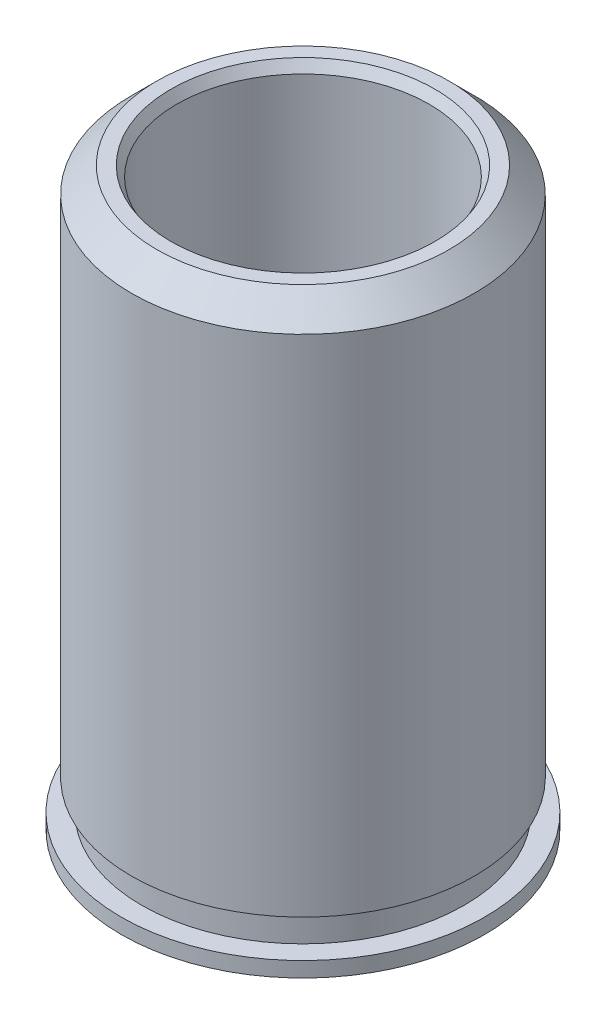
ISO-10303-21;
HEADER;
FILE_DESCRIPTION(('STEP AP214'),'2;1');
FILE_NAME('part.step','',(''),(''),'','','');
FILE_SCHEMA(('AUTOMOTIVE_DESIGN { 1 0 10303 214 1 1 1 1 }'));
ENDSEC;
DATA;
#1=APPLICATION_CONTEXT('core data for automotive mechanical design processes');
#2=APPLICATION_PROTOCOL_DEFINITION('international standard','automotive_design',2000,#1);
#3=PRODUCT_CONTEXT('',#1,'mechanical');
#4=PRODUCT('Part','Part','',(#3));
#5=PRODUCT_RELATED_PRODUCT_CATEGORY('part','',(#4));
#6=PRODUCT_DEFINITION_FORMATION('','',#4);
#7=PRODUCT_DEFINITION_CONTEXT('part definition',#1,'design');
#8=PRODUCT_DEFINITION('design','',#6,#7);
#9=PRODUCT_DEFINITION_SHAPE('','',#8);
#10=(LENGTH_UNIT() NAMED_UNIT(*) SI_UNIT(.MILLI.,.METRE.));
#11=(NAMED_UNIT(*) PLANE_ANGLE_UNIT() SI_UNIT($,.RADIAN.));
#12=(NAMED_UNIT(*) SI_UNIT($,.STERADIAN.) SOLID_ANGLE_UNIT());
#13=UNCERTAINTY_MEASURE_WITH_UNIT(LENGTH_MEASURE(1.E-05),#10,'distance_accuracy_value','');
#14=(GEOMETRIC_REPRESENTATION_CONTEXT(3) GLOBAL_UNCERTAINTY_ASSIGNED_CONTEXT((#13)) GLOBAL_UNIT_ASSIGNED_CONTEXT((#10,
#11,#12)) REPRESENTATION_CONTEXT('',''));
#15=CARTESIAN_POINT('',(0.,0.,0.));
#16=DIRECTION('',(0.,0.,1.));
#17=DIRECTION('',(1.,0.,0.));
#18=AXIS2_PLACEMENT_3D('',#15,#16,#17);
#19=CARTESIAN_POINT('',(0.,7.239,0.));
#20=DIRECTION('',(0.,1.,0.));
#21=DIRECTION('',(0.,0.,1.));
#22=AXIS2_PLACEMENT_3D('',#19,#20,#21);
#23=CYLINDRICAL_SURFACE('',#22,4.572);
#24=CARTESIAN_POINT('',(0.,-7.239,0.));
#25=DIRECTION('',(0.,1.,0.));
#26=DIRECTION('',(0.,0.,1.));
#27=AXIS2_PLACEMENT_3D('',#24,#25,#26);
#28=CIRCLE('',#27,4.572);
#29=CARTESIAN_POINT('',(0.,-7.239,4.572));
#30=VERTEX_POINT('',#29);
#31=EDGE_CURVE('E51',#30,#30,#28,.T.);
#32=ORIENTED_EDGE('',*,*,#31,.T.);
#33=EDGE_LOOP('',(#32));
#34=FACE_BOUND('',#33,.T.);
#35=CARTESIAN_POINT('',(0.,-6.858,0.));
#36=DIRECTION('',(0.,1.,0.));
#37=DIRECTION('',(0.,0.,1.));
#38=AXIS2_PLACEMENT_3D('',#35,#36,#37);
#39=CIRCLE('',#38,4.572);
#40=CARTESIAN_POINT('',(0.,-6.858,4.572));
#41=VERTEX_POINT('',#40);
#42=EDGE_CURVE('E9',#41,#41,#39,.T.);
#43=ORIENTED_EDGE('',*,*,#42,.F.);
#44=EDGE_LOOP('',(#43));
#45=FACE_BOUND('',#44,.T.);
#46=ADVANCED_FACE('F14',(#34,#45),#23,.T.);
#47=CARTESIAN_POINT('',(2.286,-6.858,0.));
#48=DIRECTION('',(0.,1.,0.));
#49=DIRECTION('',(0.,0.,1.));
#50=AXIS2_PLACEMENT_3D('',#47,#48,#49);
#51=PLANE('',#50);
#52=ORIENTED_EDGE('',*,*,#42,.T.);
#53=EDGE_LOOP('',(#52));
#54=FACE_BOUND('',#53,.T.);
#55=CARTESIAN_POINT('',(0.,-6.858,0.));
#56=DIRECTION('',(0.,1.,0.));
#57=DIRECTION('',(0.,0.,1.));
#58=AXIS2_PLACEMENT_3D('',#55,#56,#57);
#59=CIRCLE('',#58,4.05765);
#60=CARTESIAN_POINT('',(0.,-6.858,4.05765));
#61=VERTEX_POINT('',#60);
#62=EDGE_CURVE('E20',#61,#61,#59,.T.);
#63=ORIENTED_EDGE('',*,*,#62,.F.);
#64=EDGE_LOOP('',(#63));
#65=FACE_BOUND('',#64,.T.);
#66=ADVANCED_FACE('F77',(#54,#65),#51,.T.);
#67=CARTESIAN_POINT('',(0.,7.239,0.));
#68=DIRECTION('',(0.,1.,0.));
#69=DIRECTION('',(0.,0.,1.));
#70=AXIS2_PLACEMENT_3D('',#67,#68,#69);
#71=CYLINDRICAL_SURFACE('',#70,4.05765);
#72=ORIENTED_EDGE('',*,*,#62,.T.);
#73=EDGE_LOOP('',(#72));
#74=FACE_BOUND('',#73,.T.);
#75=CARTESIAN_POINT('',(0.,-6.096,0.));
#76=DIRECTION('',(0.,1.,0.));
#77=DIRECTION('',(0.,0.,1.));
#78=AXIS2_PLACEMENT_3D('',#75,#76,#77);
#79=CIRCLE('',#78,4.05765);
#80=CARTESIAN_POINT('',(0.,-6.096,4.05765));
#81=VERTEX_POINT('',#80);
#82=EDGE_CURVE('E24',#81,#81,#79,.T.);
#83=ORIENTED_EDGE('',*,*,#82,.F.);
#84=EDGE_LOOP('',(#83));
#85=FACE_BOUND('',#84,.T.);
#86=ADVANCED_FACE('F82',(#74,#85),#71,.T.);
#87=CARTESIAN_POINT('',(2.286,-6.096,0.));
#88=DIRECTION('',(0.,-1.,0.));
#89=DIRECTION('',(0.,0.,-1.));
#90=AXIS2_PLACEMENT_3D('',#87,#88,#89);
#91=PLANE('',#90);
#92=ORIENTED_EDGE('',*,*,#82,.T.);
#93=EDGE_LOOP('',(#92));
#94=FACE_BOUND('',#93,.T.);
#95=CARTESIAN_POINT('',(0.,-6.096,0.));
#96=DIRECTION('',(0.,1.,0.));
#97=DIRECTION('',(0.,0.,1.));
#98=AXIS2_PLACEMENT_3D('',#95,#96,#97);
#99=CIRCLE('',#98,4.31165);
#100=CARTESIAN_POINT('',(0.,-6.096,4.31165));
#101=VERTEX_POINT('',#100);
#102=EDGE_CURVE('E28',#101,#101,#99,.T.);
#103=ORIENTED_EDGE('',*,*,#102,.F.);
#104=EDGE_LOOP('',(#103));
#105=FACE_BOUND('',#104,.T.);
#106=ADVANCED_FACE('F87',(#94,#105),#91,.T.);
#107=CARTESIAN_POINT('',(0.,7.239,0.));
#108=DIRECTION('',(0.,1.,0.));
#109=DIRECTION('',(0.,0.,1.));
#110=AXIS2_PLACEMENT_3D('',#107,#108,#109);
#111=CYLINDRICAL_SURFACE('',#110,4.31165);
#112=ORIENTED_EDGE('',*,*,#102,.T.);
#113=EDGE_LOOP('',(#112));
#114=FACE_BOUND('',#113,.T.);
#115=CARTESIAN_POINT('',(0.,6.604,0.));
#116=DIRECTION('',(0.,1.,0.));
#117=DIRECTION('',(0.,0.,1.));
#118=AXIS2_PLACEMENT_3D('',#115,#116,#117);
#119=CIRCLE('',#118,4.31164999999999);
#120=CARTESIAN_POINT('',(0.,6.604,4.31164999999999));
#121=VERTEX_POINT('',#120);
#122=EDGE_CURVE('E33',#121,#121,#119,.T.);
#123=ORIENTED_EDGE('',*,*,#122,.F.);
#124=EDGE_LOOP('',(#123));
#125=FACE_BOUND('',#124,.T.);
#126=ADVANCED_FACE('F93',(#114,#125),#111,.T.);
#127=CARTESIAN_POINT('',(0.,7.239,0.));
#128=DIRECTION('',(0.,-1.,0.));
#129=DIRECTION('',(0.,0.,-1.));
#130=AXIS2_PLACEMENT_3D('',#127,#128,#129);
#131=CONICAL_SURFACE('',#130,3.67665,0.785398163397446);
#132=ORIENTED_EDGE('',*,*,#122,.T.);
#133=EDGE_LOOP('',(#132));
#134=FACE_BOUND('',#133,.T.);
#135=CARTESIAN_POINT('',(0.,7.239,0.));
#136=DIRECTION('',(0.,1.,0.));
#137=DIRECTION('',(0.,0.,1.));
#138=AXIS2_PLACEMENT_3D('',#135,#136,#137);
#139=CIRCLE('',#138,3.67665);
#140=CARTESIAN_POINT('',(0.,7.239,3.67665));
#141=VERTEX_POINT('',#140);
#142=EDGE_CURVE('E36',#141,#141,#139,.T.);
#143=ORIENTED_EDGE('',*,*,#142,.F.);
#144=EDGE_LOOP('',(#143));
#145=FACE_BOUND('',#144,.T.);
#146=ADVANCED_FACE('F97',(#134,#145),#131,.T.);
#147=CARTESIAN_POINT('',(2.286,7.239,0.));
#148=DIRECTION('',(0.,1.,0.));
#149=DIRECTION('',(0.,0.,1.));
#150=AXIS2_PLACEMENT_3D('',#147,#148,#149);
#151=PLANE('',#150);
#152=ORIENTED_EDGE('',*,*,#142,.T.);
#153=EDGE_LOOP('',(#152));
#154=FACE_BOUND('',#153,.T.);
#155=CARTESIAN_POINT('',(0.,7.239,0.));
#156=DIRECTION('',(0.,1.,0.));
#157=DIRECTION('',(0.,0.,1.));
#158=AXIS2_PLACEMENT_3D('',#155,#156,#157);
#159=CIRCLE('',#158,3.32164696837416);
#160=CARTESIAN_POINT('',(0.,7.239,3.32164696837416));
#161=VERTEX_POINT('',#160);
#162=EDGE_CURVE('E39',#161,#161,#159,.T.);
#163=ORIENTED_EDGE('',*,*,#162,.F.);
#164=EDGE_LOOP('',(#163));
#165=FACE_BOUND('',#164,.T.);
#166=ADVANCED_FACE('F101',(#154,#165),#151,.T.);
#167=CARTESIAN_POINT('',(0.,6.985,0.));
#168=DIRECTION('',(0.,1.,0.));
#169=DIRECTION('',(0.,0.,1.));
#170=AXIS2_PLACEMENT_3D('',#167,#168,#169);
#171=CONICAL_SURFACE('',#170,3.175,0.523598775598296);
#172=ORIENTED_EDGE('',*,*,#162,.T.);
#173=EDGE_LOOP('',(#172));
#174=FACE_BOUND('',#173,.T.);
#175=CARTESIAN_POINT('',(0.,6.985,0.));
#176=DIRECTION('',(0.,1.,0.));
#177=DIRECTION('',(0.,0.,1.));
#178=AXIS2_PLACEMENT_3D('',#175,#176,#177);
#179=CIRCLE('',#178,3.175);
#180=CARTESIAN_POINT('',(0.,6.985,3.175));
#181=VERTEX_POINT('',#180);
#182=EDGE_CURVE('E42',#181,#181,#179,.T.);
#183=ORIENTED_EDGE('',*,*,#182,.F.);
#184=EDGE_LOOP('',(#183));
#185=FACE_BOUND('',#184,.T.);
#186=ADVANCED_FACE('F73',(#174,#185),#171,.F.);
#187=CARTESIAN_POINT('',(0.,7.239,0.));
#188=DIRECTION('',(0.,1.,0.));
#189=DIRECTION('',(0.,0.,1.));
#190=AXIS2_PLACEMENT_3D('',#187,#188,#189);
#191=CYLINDRICAL_SURFACE('',#190,3.175);
#192=ORIENTED_EDGE('',*,*,#182,.T.);
#193=EDGE_LOOP('',(#192));
#194=FACE_BOUND('',#193,.T.);
#195=CARTESIAN_POINT('',(0.,-6.985,0.));
#196=DIRECTION('',(0.,1.,0.));
#197=DIRECTION('',(0.,0.,1.));
#198=AXIS2_PLACEMENT_3D('',#195,#196,#197);
#199=CIRCLE('',#198,3.175);
#200=CARTESIAN_POINT('',(0.,-6.985,3.175));
#201=VERTEX_POINT('',#200);
#202=EDGE_CURVE('E45',#201,#201,#199,.T.);
#203=ORIENTED_EDGE('',*,*,#202,.F.);
#204=EDGE_LOOP('',(#203));
#205=FACE_BOUND('',#204,.T.);
#206=ADVANCED_FACE('F65',(#194,#205),#191,.F.);
#207=CARTESIAN_POINT('',(0.,-7.239,0.));
#208=DIRECTION('',(0.,-1.,0.));
#209=DIRECTION('',(0.,0.,-1.));
#210=AXIS2_PLACEMENT_3D('',#207,#208,#209);
#211=CONICAL_SURFACE('',#210,3.32164696837416,0.523598775598303);
#212=ORIENTED_EDGE('',*,*,#202,.T.);
#213=EDGE_LOOP('',(#212));
#214=FACE_BOUND('',#213,.T.);
#215=CARTESIAN_POINT('',(0.,-7.239,0.));
#216=DIRECTION('',(0.,1.,0.));
#217=DIRECTION('',(0.,0.,1.));
#218=AXIS2_PLACEMENT_3D('',#215,#216,#217);
#219=CIRCLE('',#218,3.32164696837416);
#220=CARTESIAN_POINT('',(0.,-7.239,3.32164696837416));
#221=VERTEX_POINT('',#220);
#222=EDGE_CURVE('E48',#221,#221,#219,.T.);
#223=ORIENTED_EDGE('',*,*,#222,.F.);
#224=EDGE_LOOP('',(#223));
#225=FACE_BOUND('',#224,.T.);
#226=ADVANCED_FACE('F60',(#214,#225),#211,.F.);
#227=CARTESIAN_POINT('',(2.286,-7.239,0.));
#228=DIRECTION('',(0.,1.,0.));
#229=DIRECTION('',(0.,0.,1.));
#230=AXIS2_PLACEMENT_3D('',#227,#228,#229);
#231=PLANE('',#230);
#232=ORIENTED_EDGE('',*,*,#31,.F.);
#233=EDGE_LOOP('',(#232));
#234=FACE_BOUND('',#233,.T.);
#235=ORIENTED_EDGE('',*,*,#222,.T.);
#236=EDGE_LOOP('',(#235));
#237=FACE_BOUND('',#236,.T.);
#238=ADVANCED_FACE('F57',(#234,#237),#231,.F.);
#239=CLOSED_SHELL('',(#46,#66,#86,#106,#126,#146,#166,#186,#206,#226,#238));
#240=MANIFOLD_SOLID_BREP('B1',#239);
#241=ADVANCED_BREP_SHAPE_REPRESENTATION('',(#18,#240),#14);
#242=SHAPE_DEFINITION_REPRESENTATION(#9,#241);
ENDSEC;
END-ISO-10303-21;
